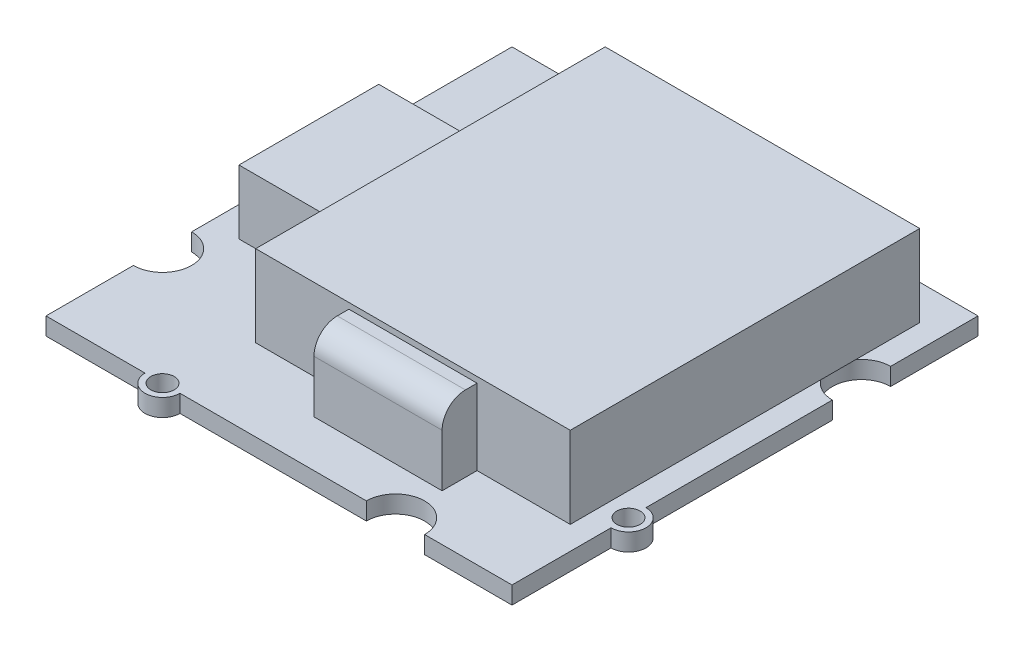
ISO-10303-21;
HEADER;
FILE_DESCRIPTION(('STEP AP214'),'2;1');
FILE_NAME('part.step','',(''),(''),'','','');
FILE_SCHEMA(('AUTOMOTIVE_DESIGN { 1 0 10303 214 1 1 1 1 }'));
ENDSEC;
DATA;
#1=APPLICATION_CONTEXT('core data for automotive mechanical design processes');
#2=APPLICATION_PROTOCOL_DEFINITION('international standard','automotive_design',2000,#1);
#3=PRODUCT_CONTEXT('',#1,'mechanical');
#4=PRODUCT('Part','Part','',(#3));
#5=PRODUCT_RELATED_PRODUCT_CATEGORY('part','',(#4));
#6=PRODUCT_DEFINITION_FORMATION('','',#4);
#7=PRODUCT_DEFINITION_CONTEXT('part definition',#1,'design');
#8=PRODUCT_DEFINITION('design','',#6,#7);
#9=PRODUCT_DEFINITION_SHAPE('','',#8);
#10=(LENGTH_UNIT() NAMED_UNIT(*) SI_UNIT(.MILLI.,.METRE.));
#11=(NAMED_UNIT(*) PLANE_ANGLE_UNIT() SI_UNIT($,.RADIAN.));
#12=(NAMED_UNIT(*) SI_UNIT($,.STERADIAN.) SOLID_ANGLE_UNIT());
#13=UNCERTAINTY_MEASURE_WITH_UNIT(LENGTH_MEASURE(1.E-05),#10,'distance_accuracy_value','');
#14=(GEOMETRIC_REPRESENTATION_CONTEXT(3) GLOBAL_UNCERTAINTY_ASSIGNED_CONTEXT((#13)) GLOBAL_UNIT_ASSIGNED_CONTEXT((#10,
#11,#12)) REPRESENTATION_CONTEXT('',''));
#15=CARTESIAN_POINT('',(0.,0.,0.));
#16=DIRECTION('',(0.,0.,1.));
#17=DIRECTION('',(1.,0.,0.));
#18=AXIS2_PLACEMENT_3D('',#15,#16,#17);
#19=CARTESIAN_POINT('',(0.,1.5,0.));
#20=DIRECTION('',(0.,1.,0.));
#21=DIRECTION('',(0.,0.,1.));
#22=AXIS2_PLACEMENT_3D('',#19,#20,#21);
#23=PLANE('',#22);
#24=CARTESIAN_POINT('',(-10.,1.5,20.));
#25=DIRECTION('',(0.,1.,0.));
#26=DIRECTION('',(0.,0.,1.));
#27=AXIS2_PLACEMENT_3D('',#24,#25,#26);
#28=CIRCLE('',#27,1.);
#29=CARTESIAN_POINT('',(-10.,1.5,21.));
#30=VERTEX_POINT('',#29);
#31=EDGE_CURVE('E385',#30,#30,#28,.T.);
#32=ORIENTED_EDGE('',*,*,#31,.F.);
#33=EDGE_LOOP('',(#32));
#34=FACE_BOUND('',#33,.T.);
#35=CARTESIAN_POINT('',(20.,1.5,10.));
#36=DIRECTION('',(0.,1.,0.));
#37=DIRECTION('',(0.,0.,1.));
#38=AXIS2_PLACEMENT_3D('',#35,#36,#37);
#39=CIRCLE('',#38,1.);
#40=CARTESIAN_POINT('',(20.,1.5,11.));
#41=VERTEX_POINT('',#40);
#42=EDGE_CURVE('E389',#41,#41,#39,.T.);
#43=ORIENTED_EDGE('',*,*,#42,.F.);
#44=EDGE_LOOP('',(#43));
#45=FACE_BOUND('',#44,.T.);
#46=CARTESIAN_POINT('',(10.,1.5,-20.));
#47=DIRECTION('',(0.,1.,0.));
#48=DIRECTION('',(0.,0.,1.));
#49=AXIS2_PLACEMENT_3D('',#46,#47,#48);
#50=CIRCLE('',#49,1.);
#51=CARTESIAN_POINT('',(10.,1.5,-19.));
#52=VERTEX_POINT('',#51);
#53=EDGE_CURVE('E395',#52,#52,#50,.T.);
#54=ORIENTED_EDGE('',*,*,#53,.F.);
#55=EDGE_LOOP('',(#54));
#56=FACE_BOUND('',#55,.T.);
#57=CARTESIAN_POINT('',(-20.,1.5,-10.));
#58=DIRECTION('',(0.,1.,0.));
#59=DIRECTION('',(0.,0.,1.));
#60=AXIS2_PLACEMENT_3D('',#57,#58,#59);
#61=CIRCLE('',#60,1.);
#62=CARTESIAN_POINT('',(-20.,1.5,-9.));
#63=VERTEX_POINT('',#62);
#64=EDGE_CURVE('E401',#63,#63,#61,.T.);
#65=ORIENTED_EDGE('',*,*,#64,.F.);
#66=EDGE_LOOP('',(#65));
#67=FACE_BOUND('',#66,.T.);
#68=DIRECTION('',(-1.,0.,0.));
#69=VECTOR('',#68,1.);
#70=CARTESIAN_POINT('',(-17.4388898299039,1.5,-6.));
#71=LINE('',#70,#69);
#72=CARTESIAN_POINT('',(-9.43888982990389,1.5,-6.));
#73=VERTEX_POINT('',#72);
#74=CARTESIAN_POINT('',(-17.4388898299039,1.5,-6.));
#75=VERTEX_POINT('',#74);
#76=EDGE_CURVE('E329',#73,#75,#71,.T.);
#77=ORIENTED_EDGE('',*,*,#76,.F.);
#78=DIRECTION('',(0.,0.,-1.));
#79=VECTOR('',#78,1.);
#80=CARTESIAN_POINT('',(-9.43888982990389,1.5,-6.));
#81=LINE('',#80,#79);
#82=CARTESIAN_POINT('',(-9.43888982990389,1.5,6.));
#83=VERTEX_POINT('',#82);
#84=EDGE_CURVE('E315',#83,#73,#81,.T.);
#85=ORIENTED_EDGE('',*,*,#84,.F.);
#86=DIRECTION('',(1.,0.,0.));
#87=VECTOR('',#86,1.);
#88=CARTESIAN_POINT('',(-17.4388898299039,1.5,6.));
#89=LINE('',#88,#87);
#90=CARTESIAN_POINT('',(-17.4388898299039,1.5,6.));
#91=VERTEX_POINT('',#90);
#92=EDGE_CURVE('E320',#91,#83,#89,.T.);
#93=ORIENTED_EDGE('',*,*,#92,.F.);
#94=DIRECTION('',(0.,0.,1.));
#95=VECTOR('',#94,1.);
#96=CARTESIAN_POINT('',(-17.4388898299039,1.5,-6.));
#97=LINE('',#96,#95);
#98=EDGE_CURVE('E331',#75,#91,#97,.T.);
#99=ORIENTED_EDGE('',*,*,#98,.F.);
#100=EDGE_LOOP('',(#77,#85,#93,#99));
#101=FACE_BOUND('',#100,.T.);
#102=DIRECTION('',(1.,0.,0.));
#103=VECTOR('',#102,1.);
#104=CARTESIAN_POINT('',(-8.99999999999999,1.5,13.));
#105=LINE('',#104,#103);
#106=CARTESIAN_POINT('',(10.,1.5,13.));
#107=VERTEX_POINT('',#106);
#108=CARTESIAN_POINT('',(18.,1.5,13.));
#109=VERTEX_POINT('',#108);
#110=EDGE_CURVE('E303',#107,#109,#105,.T.);
#111=ORIENTED_EDGE('',*,*,#110,.F.);
#112=DIRECTION('',(0.,0.,-1.));
#113=VECTOR('',#112,1.);
#114=CARTESIAN_POINT('',(10.,1.5,13.));
#115=LINE('',#114,#113);
#116=CARTESIAN_POINT('',(10.,1.5,16.));
#117=VERTEX_POINT('',#116);
#118=EDGE_CURVE('E517',#117,#107,#115,.T.);
#119=ORIENTED_EDGE('',*,*,#118,.F.);
#120=DIRECTION('',(1.,0.,0.));
#121=VECTOR('',#120,1.);
#122=CARTESIAN_POINT('',(-0.999999999999996,1.5,16.));
#123=LINE('',#122,#121);
#124=CARTESIAN_POINT('',(-0.999999999999996,1.5,16.));
#125=VERTEX_POINT('',#124);
#126=EDGE_CURVE('E511',#125,#117,#123,.T.);
#127=ORIENTED_EDGE('',*,*,#126,.F.);
#128=DIRECTION('',(0.,0.,1.));
#129=VECTOR('',#128,1.);
#130=CARTESIAN_POINT('',(-0.999999999999996,1.5,13.));
#131=LINE('',#130,#129);
#132=CARTESIAN_POINT('',(-0.999999999999996,1.5,13.));
#133=VERTEX_POINT('',#132);
#134=EDGE_CURVE('E514',#133,#125,#131,.T.);
#135=ORIENTED_EDGE('',*,*,#134,.F.);
#136=CARTESIAN_POINT('',(-8.99999999999999,1.5,13.));
#137=VERTEX_POINT('',#136);
#138=EDGE_CURVE('E277',#137,#133,#105,.T.);
#139=ORIENTED_EDGE('',*,*,#138,.F.);
#140=DIRECTION('',(0.,0.,1.));
#141=VECTOR('',#140,1.);
#142=CARTESIAN_POINT('',(-9.,1.5,-17.));
#143=LINE('',#142,#141);
#144=CARTESIAN_POINT('',(-9.,1.5,-17.));
#145=VERTEX_POINT('',#144);
#146=EDGE_CURVE('E301',#145,#137,#143,.T.);
#147=ORIENTED_EDGE('',*,*,#146,.F.);
#148=DIRECTION('',(-1.,0.,0.));
#149=VECTOR('',#148,1.);
#150=CARTESIAN_POINT('',(-9.,1.5,-17.));
#151=LINE('',#150,#149);
#152=CARTESIAN_POINT('',(18.,1.5,-17.));
#153=VERTEX_POINT('',#152);
#154=EDGE_CURVE('E298',#153,#145,#151,.T.);
#155=ORIENTED_EDGE('',*,*,#154,.F.);
#156=DIRECTION('',(0.,0.,-1.));
#157=VECTOR('',#156,1.);
#158=CARTESIAN_POINT('',(18.,1.5,-17.));
#159=LINE('',#158,#157);
#160=CARTESIAN_POINT('',(18.,1.5,-11.5));
#161=VERTEX_POINT('',#160);
#162=EDGE_CURVE('E281',#161,#153,#159,.T.);
#163=ORIENTED_EDGE('',*,*,#162,.F.);
#164=CARTESIAN_POINT('',(20.,1.5,-10.));
#165=DIRECTION('',(0.,1.,0.));
#166=DIRECTION('',(0.,0.,1.));
#167=AXIS2_PLACEMENT_3D('',#164,#165,#166);
#168=CIRCLE('',#167,2.5);
#169=CARTESIAN_POINT('',(20.,1.5,-12.5));
#170=VERTEX_POINT('',#169);
#171=EDGE_CURVE('E367',#170,#161,#168,.T.);
#172=ORIENTED_EDGE('',*,*,#171,.F.);
#173=DIRECTION('',(0.,0.,-1.));
#174=VECTOR('',#173,1.);
#175=CARTESIAN_POINT('',(20.,1.5,-20.));
#176=LINE('',#175,#174);
#177=CARTESIAN_POINT('',(20.,1.5,-20.));
#178=VERTEX_POINT('',#177);
#179=EDGE_CURVE('E455',#170,#178,#176,.T.);
#180=ORIENTED_EDGE('',*,*,#179,.T.);
#181=DIRECTION('',(-1.,0.,0.));
#182=VECTOR('',#181,1.);
#183=CARTESIAN_POINT('',(-20.,1.5,-20.));
#184=LINE('',#183,#182);
#185=CARTESIAN_POINT('',(11.5,1.5,-20.));
#186=VERTEX_POINT('',#185);
#187=EDGE_CURVE('E456',#178,#186,#184,.T.);
#188=ORIENTED_EDGE('',*,*,#187,.T.);
#189=CARTESIAN_POINT('',(10.,1.5,-20.));
#190=DIRECTION('',(0.,1.,0.));
#191=DIRECTION('',(0.,0.,1.));
#192=AXIS2_PLACEMENT_3D('',#189,#190,#191);
#193=CIRCLE('',#192,1.5);
#194=CARTESIAN_POINT('',(8.5,1.5,-20.));
#195=VERTEX_POINT('',#194);
#196=EDGE_CURVE('E429',#186,#195,#193,.T.);
#197=ORIENTED_EDGE('',*,*,#196,.T.);
#198=CARTESIAN_POINT('',(-7.5,1.5,-20.));
#199=VERTEX_POINT('',#198);
#200=EDGE_CURVE('E460',#195,#199,#184,.T.);
#201=ORIENTED_EDGE('',*,*,#200,.T.);
#202=CARTESIAN_POINT('',(-10.,1.5,-20.));
#203=DIRECTION('',(0.,1.,0.));
#204=DIRECTION('',(0.,0.,1.));
#205=AXIS2_PLACEMENT_3D('',#202,#203,#204);
#206=CIRCLE('',#205,2.5);
#207=CARTESIAN_POINT('',(-12.5,1.5,-20.));
#208=VERTEX_POINT('',#207);
#209=EDGE_CURVE('E377',#208,#199,#206,.T.);
#210=ORIENTED_EDGE('',*,*,#209,.F.);
#211=CARTESIAN_POINT('',(-20.,1.5,-20.));
#212=VERTEX_POINT('',#211);
#213=EDGE_CURVE('E453',#208,#212,#184,.T.);
#214=ORIENTED_EDGE('',*,*,#213,.T.);
#215=DIRECTION('',(0.,0.,1.));
#216=VECTOR('',#215,1.);
#217=CARTESIAN_POINT('',(-20.,1.5,-20.));
#218=LINE('',#217,#216);
#219=CARTESIAN_POINT('',(-20.,1.5,-11.5));
#220=VERTEX_POINT('',#219);
#221=EDGE_CURVE('E461',#212,#220,#218,.T.);
#222=ORIENTED_EDGE('',*,*,#221,.T.);
#223=CARTESIAN_POINT('',(-20.,1.5,-10.));
#224=DIRECTION('',(0.,1.,0.));
#225=DIRECTION('',(0.,0.,1.));
#226=AXIS2_PLACEMENT_3D('',#223,#224,#225);
#227=CIRCLE('',#226,1.5);
#228=CARTESIAN_POINT('',(-20.,1.5,-8.5));
#229=VERTEX_POINT('',#228);
#230=EDGE_CURVE('E439',#220,#229,#227,.T.);
#231=ORIENTED_EDGE('',*,*,#230,.T.);
#232=CARTESIAN_POINT('',(-20.,1.5,7.5));
#233=VERTEX_POINT('',#232);
#234=EDGE_CURVE('E465',#229,#233,#218,.T.);
#235=ORIENTED_EDGE('',*,*,#234,.T.);
#236=CARTESIAN_POINT('',(-20.,1.5,10.));
#237=DIRECTION('',(0.,1.,0.));
#238=DIRECTION('',(0.,0.,1.));
#239=AXIS2_PLACEMENT_3D('',#236,#237,#238);
#240=CIRCLE('',#239,2.5);
#241=CARTESIAN_POINT('',(-20.,1.5,12.5));
#242=VERTEX_POINT('',#241);
#243=EDGE_CURVE('E344',#242,#233,#240,.T.);
#244=ORIENTED_EDGE('',*,*,#243,.F.);
#245=CARTESIAN_POINT('',(-20.,1.5,20.));
#246=VERTEX_POINT('',#245);
#247=EDGE_CURVE('E459',#242,#246,#218,.T.);
#248=ORIENTED_EDGE('',*,*,#247,.T.);
#249=DIRECTION('',(1.,0.,0.));
#250=VECTOR('',#249,1.);
#251=CARTESIAN_POINT('',(-20.,1.5,20.));
#252=LINE('',#251,#250);
#253=CARTESIAN_POINT('',(-11.5,1.5,20.));
#254=VERTEX_POINT('',#253);
#255=EDGE_CURVE('E466',#246,#254,#252,.T.);
#256=ORIENTED_EDGE('',*,*,#255,.T.);
#257=CARTESIAN_POINT('',(-10.,1.5,20.));
#258=DIRECTION('',(0.,1.,0.));
#259=DIRECTION('',(0.,0.,1.));
#260=AXIS2_PLACEMENT_3D('',#257,#258,#259);
#261=CIRCLE('',#260,1.5);
#262=CARTESIAN_POINT('',(-8.5,1.5,20.));
#263=VERTEX_POINT('',#262);
#264=EDGE_CURVE('E407',#254,#263,#261,.T.);
#265=ORIENTED_EDGE('',*,*,#264,.T.);
#266=CARTESIAN_POINT('',(7.50000000000001,1.5,20.));
#267=VERTEX_POINT('',#266);
#268=EDGE_CURVE('E470',#263,#267,#252,.T.);
#269=ORIENTED_EDGE('',*,*,#268,.T.);
#270=CARTESIAN_POINT('',(10.,1.5,20.));
#271=DIRECTION('',(0.,1.,0.));
#272=DIRECTION('',(0.,0.,1.));
#273=AXIS2_PLACEMENT_3D('',#270,#271,#272);
#274=CIRCLE('',#273,2.5);
#275=CARTESIAN_POINT('',(12.5,1.5,20.));
#276=VERTEX_POINT('',#275);
#277=EDGE_CURVE('E355',#276,#267,#274,.T.);
#278=ORIENTED_EDGE('',*,*,#277,.F.);
#279=CARTESIAN_POINT('',(20.,1.5,20.));
#280=VERTEX_POINT('',#279);
#281=EDGE_CURVE('E464',#276,#280,#252,.T.);
#282=ORIENTED_EDGE('',*,*,#281,.T.);
#283=CARTESIAN_POINT('',(20.,1.5,11.5));
#284=VERTEX_POINT('',#283);
#285=EDGE_CURVE('E450',#280,#284,#176,.T.);
#286=ORIENTED_EDGE('',*,*,#285,.T.);
#287=CARTESIAN_POINT('',(20.,1.5,10.));
#288=DIRECTION('',(0.,1.,0.));
#289=DIRECTION('',(0.,0.,1.));
#290=AXIS2_PLACEMENT_3D('',#287,#288,#289);
#291=CIRCLE('',#290,1.5);
#292=CARTESIAN_POINT('',(20.,1.5,8.5));
#293=VERTEX_POINT('',#292);
#294=EDGE_CURVE('E419',#284,#293,#291,.T.);
#295=ORIENTED_EDGE('',*,*,#294,.T.);
#296=CARTESIAN_POINT('',(20.,1.5,-7.5));
#297=VERTEX_POINT('',#296);
#298=EDGE_CURVE('E454',#293,#297,#176,.T.);
#299=ORIENTED_EDGE('',*,*,#298,.T.);
#300=CARTESIAN_POINT('',(18.,1.5,-8.5));
#301=VERTEX_POINT('',#300);
#302=EDGE_CURVE('E366',#301,#297,#168,.T.);
#303=ORIENTED_EDGE('',*,*,#302,.F.);
#304=EDGE_CURVE('E296',#109,#301,#159,.T.);
#305=ORIENTED_EDGE('',*,*,#304,.F.);
#306=EDGE_LOOP('',(#111,#119,#127,#135,#139,#147,#155,#163,#172,#180,#188,#197,#201,#210,#214,
#222,#231,#235,#244,#248,#256,#265,#269,#278,#282,#286,#295,#299,#303,#305));
#307=FACE_BOUND('',#306,.T.);
#308=ADVANCED_FACE('F34',(#34,#45,#56,#67,#101,#307),#23,.T.);
#309=CARTESIAN_POINT('',(-8.99999999999999,8.5,13.));
#310=DIRECTION('',(0.,0.,-1.));
#311=DIRECTION('',(-1.,0.,0.));
#312=AXIS2_PLACEMENT_3D('',#309,#310,#311);
#313=PLANE('',#312);
#314=DIRECTION('',(0.,-1.,0.));
#315=VECTOR('',#314,1.);
#316=CARTESIAN_POINT('',(10.,8.,13.));
#317=LINE('',#316,#315);
#318=CARTESIAN_POINT('',(10.,8.,13.));
#319=VERTEX_POINT('',#318);
#320=EDGE_CURVE('E278',#319,#107,#317,.T.);
#321=ORIENTED_EDGE('',*,*,#320,.T.);
#322=ORIENTED_EDGE('',*,*,#110,.T.);
#323=DIRECTION('',(0.,-1.,0.));
#324=VECTOR('',#323,1.);
#325=CARTESIAN_POINT('',(18.,8.5,13.));
#326=LINE('',#325,#324);
#327=CARTESIAN_POINT('',(18.,8.5,13.));
#328=VERTEX_POINT('',#327);
#329=EDGE_CURVE('E295',#328,#109,#326,.T.);
#330=ORIENTED_EDGE('',*,*,#329,.F.);
#331=DIRECTION('',(1.,0.,0.));
#332=VECTOR('',#331,1.);
#333=CARTESIAN_POINT('',(-8.99999999999999,8.5,13.));
#334=LINE('',#333,#332);
#335=CARTESIAN_POINT('',(-8.99999999999999,8.5,13.));
#336=VERTEX_POINT('',#335);
#337=EDGE_CURVE('E293',#336,#328,#334,.T.);
#338=ORIENTED_EDGE('',*,*,#337,.F.);
#339=DIRECTION('',(0.,-1.,0.));
#340=VECTOR('',#339,1.);
#341=CARTESIAN_POINT('',(-8.99999999999999,8.5,13.));
#342=LINE('',#341,#340);
#343=EDGE_CURVE('E307',#336,#137,#342,.T.);
#344=ORIENTED_EDGE('',*,*,#343,.T.);
#345=ORIENTED_EDGE('',*,*,#138,.T.);
#346=DIRECTION('',(0.,-1.,0.));
#347=VECTOR('',#346,1.);
#348=CARTESIAN_POINT('',(-0.999999999999996,8.,13.));
#349=LINE('',#348,#347);
#350=CARTESIAN_POINT('',(-0.999999999999996,8.,13.));
#351=VERTEX_POINT('',#350);
#352=EDGE_CURVE('E268',#351,#133,#349,.T.);
#353=ORIENTED_EDGE('',*,*,#352,.F.);
#354=DIRECTION('',(-1.,0.,0.));
#355=VECTOR('',#354,1.);
#356=CARTESIAN_POINT('',(-0.999999999999996,8.,13.));
#357=LINE('',#356,#355);
#358=EDGE_CURVE('E253',#319,#351,#357,.T.);
#359=ORIENTED_EDGE('',*,*,#358,.F.);
#360=EDGE_LOOP('',(#321,#322,#330,#338,#344,#345,#353,#359));
#361=FACE_BOUND('',#360,.T.);
#362=ADVANCED_FACE('F274',(#361),#313,.F.);
#363=CARTESIAN_POINT('',(-20.,1.5,-20.));
#364=DIRECTION('',(1.,0.,0.));
#365=DIRECTION('',(0.,0.,-1.));
#366=AXIS2_PLACEMENT_3D('',#363,#364,#365);
#367=PLANE('',#366);
#368=DIRECTION('',(0.,0.,1.));
#369=VECTOR('',#368,1.);
#370=CARTESIAN_POINT('',(-20.,0.,-20.));
#371=LINE('',#370,#369);
#372=CARTESIAN_POINT('',(-20.,0.,-8.5));
#373=VERTEX_POINT('',#372);
#374=CARTESIAN_POINT('',(-20.,0.,7.5));
#375=VERTEX_POINT('',#374);
#376=EDGE_CURVE('E485',#373,#375,#371,.T.);
#377=ORIENTED_EDGE('',*,*,#376,.T.);
#378=DIRECTION('',(0.,1.,0.));
#379=VECTOR('',#378,1.);
#380=CARTESIAN_POINT('',(-20.,0.,7.5));
#381=LINE('',#380,#379);
#382=EDGE_CURVE('E352',#375,#233,#381,.T.);
#383=ORIENTED_EDGE('',*,*,#382,.T.);
#384=ORIENTED_EDGE('',*,*,#234,.F.);
#385=DIRECTION('',(0.,1.,0.));
#386=VECTOR('',#385,1.);
#387=CARTESIAN_POINT('',(-20.,0.,-8.5));
#388=LINE('',#387,#386);
#389=EDGE_CURVE('E442',#229,#373,#388,.F.);
#390=ORIENTED_EDGE('',*,*,#389,.T.);
#391=EDGE_LOOP('',(#377,#383,#384,#390));
#392=FACE_BOUND('',#391,.T.);
#393=ADVANCED_FACE('F553',(#392),#367,.F.);
#394=CARTESIAN_POINT('',(-20.,1.5,20.));
#395=DIRECTION('',(0.,0.,-1.));
#396=DIRECTION('',(-1.,0.,0.));
#397=AXIS2_PLACEMENT_3D('',#394,#395,#396);
#398=PLANE('',#397);
#399=DIRECTION('',(1.,0.,0.));
#400=VECTOR('',#399,1.);
#401=CARTESIAN_POINT('',(-20.,0.,20.));
#402=LINE('',#401,#400);
#403=CARTESIAN_POINT('',(-8.5,0.,20.));
#404=VERTEX_POINT('',#403);
#405=CARTESIAN_POINT('',(7.50000000000001,0.,20.));
#406=VERTEX_POINT('',#405);
#407=EDGE_CURVE('E489',#404,#406,#402,.T.);
#408=ORIENTED_EDGE('',*,*,#407,.T.);
#409=DIRECTION('',(0.,1.,0.));
#410=VECTOR('',#409,1.);
#411=CARTESIAN_POINT('',(7.50000000000001,0.,20.));
#412=LINE('',#411,#410);
#413=EDGE_CURVE('E363',#406,#267,#412,.T.);
#414=ORIENTED_EDGE('',*,*,#413,.T.);
#415=ORIENTED_EDGE('',*,*,#268,.F.);
#416=DIRECTION('',(0.,1.,0.));
#417=VECTOR('',#416,1.);
#418=CARTESIAN_POINT('',(-8.5,0.,20.));
#419=LINE('',#418,#417);
#420=EDGE_CURVE('E412',#263,#404,#419,.F.);
#421=ORIENTED_EDGE('',*,*,#420,.T.);
#422=EDGE_LOOP('',(#408,#414,#415,#421));
#423=FACE_BOUND('',#422,.T.);
#424=ADVANCED_FACE('F570',(#423),#398,.F.);
#425=CARTESIAN_POINT('',(20.,1.5,-20.));
#426=DIRECTION('',(-1.,0.,0.));
#427=DIRECTION('',(0.,0.,1.));
#428=AXIS2_PLACEMENT_3D('',#425,#426,#427);
#429=PLANE('',#428);
#430=DIRECTION('',(0.,0.,-1.));
#431=VECTOR('',#430,1.);
#432=CARTESIAN_POINT('',(20.,0.,-20.));
#433=LINE('',#432,#431);
#434=CARTESIAN_POINT('',(20.,0.,8.5));
#435=VERTEX_POINT('',#434);
#436=CARTESIAN_POINT('',(20.,0.,-7.5));
#437=VERTEX_POINT('',#436);
#438=EDGE_CURVE('E475',#435,#437,#433,.T.);
#439=ORIENTED_EDGE('',*,*,#438,.T.);
#440=DIRECTION('',(0.,1.,0.));
#441=VECTOR('',#440,1.);
#442=CARTESIAN_POINT('',(20.,0.,-7.5));
#443=LINE('',#442,#441);
#444=EDGE_CURVE('E374',#437,#297,#443,.T.);
#445=ORIENTED_EDGE('',*,*,#444,.T.);
#446=ORIENTED_EDGE('',*,*,#298,.F.);
#447=DIRECTION('',(0.,1.,0.));
#448=VECTOR('',#447,1.);
#449=CARTESIAN_POINT('',(20.,0.,8.5));
#450=LINE('',#449,#448);
#451=EDGE_CURVE('E422',#293,#435,#450,.F.);
#452=ORIENTED_EDGE('',*,*,#451,.T.);
#453=EDGE_LOOP('',(#439,#445,#446,#452));
#454=FACE_BOUND('',#453,.T.);
#455=ADVANCED_FACE('F584',(#454),#429,.F.);
#456=CARTESIAN_POINT('',(-20.,1.5,-20.));
#457=DIRECTION('',(0.,0.,1.));
#458=DIRECTION('',(1.,0.,0.));
#459=AXIS2_PLACEMENT_3D('',#456,#457,#458);
#460=PLANE('',#459);
#461=DIRECTION('',(-1.,0.,0.));
#462=VECTOR('',#461,1.);
#463=CARTESIAN_POINT('',(-20.,0.,-20.));
#464=LINE('',#463,#462);
#465=CARTESIAN_POINT('',(8.5,0.,-20.));
#466=VERTEX_POINT('',#465);
#467=CARTESIAN_POINT('',(-7.5,0.,-20.));
#468=VERTEX_POINT('',#467);
#469=EDGE_CURVE('E480',#466,#468,#464,.T.);
#470=ORIENTED_EDGE('',*,*,#469,.T.);
#471=DIRECTION('',(0.,1.,0.));
#472=VECTOR('',#471,1.);
#473=CARTESIAN_POINT('',(-7.5,0.,-20.));
#474=LINE('',#473,#472);
#475=EDGE_CURVE('E382',#468,#199,#474,.T.);
#476=ORIENTED_EDGE('',*,*,#475,.T.);
#477=ORIENTED_EDGE('',*,*,#200,.F.);
#478=DIRECTION('',(0.,1.,0.));
#479=VECTOR('',#478,1.);
#480=CARTESIAN_POINT('',(8.5,0.,-20.));
#481=LINE('',#480,#479);
#482=EDGE_CURVE('E432',#195,#466,#481,.F.);
#483=ORIENTED_EDGE('',*,*,#482,.T.);
#484=EDGE_LOOP('',(#470,#476,#477,#483));
#485=FACE_BOUND('',#484,.T.);
#486=ADVANCED_FACE('F580',(#485),#460,.F.);
#487=CARTESIAN_POINT('',(-20.,0.,20.));
#488=VERTEX_POINT('',#487);
#489=CARTESIAN_POINT('',(-11.5,0.,20.));
#490=VERTEX_POINT('',#489);
#491=EDGE_CURVE('E486',#488,#490,#402,.T.);
#492=ORIENTED_EDGE('',*,*,#491,.T.);
#493=DIRECTION('',(0.,1.,0.));
#494=VECTOR('',#493,1.);
#495=CARTESIAN_POINT('',(-11.5,0.,20.));
#496=LINE('',#495,#494);
#497=EDGE_CURVE('E416',#490,#254,#496,.T.);
#498=ORIENTED_EDGE('',*,*,#497,.T.);
#499=ORIENTED_EDGE('',*,*,#255,.F.);
#500=DIRECTION('',(0.,-1.,0.));
#501=VECTOR('',#500,1.);
#502=CARTESIAN_POINT('',(-20.,1.5,20.));
#503=LINE('',#502,#501);
#504=EDGE_CURVE('E492',#246,#488,#503,.T.);
#505=ORIENTED_EDGE('',*,*,#504,.T.);
#506=EDGE_LOOP('',(#492,#498,#499,#505));
#507=FACE_BOUND('',#506,.T.);
#508=ADVANCED_FACE('F571',(#507),#398,.F.);
#509=CARTESIAN_POINT('',(20.,0.,20.));
#510=VERTEX_POINT('',#509);
#511=CARTESIAN_POINT('',(20.,0.,11.5));
#512=VERTEX_POINT('',#511);
#513=EDGE_CURVE('E471',#510,#512,#433,.T.);
#514=ORIENTED_EDGE('',*,*,#513,.T.);
#515=DIRECTION('',(0.,1.,0.));
#516=VECTOR('',#515,1.);
#517=CARTESIAN_POINT('',(20.,0.,11.5));
#518=LINE('',#517,#516);
#519=EDGE_CURVE('E426',#512,#284,#518,.T.);
#520=ORIENTED_EDGE('',*,*,#519,.T.);
#521=ORIENTED_EDGE('',*,*,#285,.F.);
#522=DIRECTION('',(0.,-1.,0.));
#523=VECTOR('',#522,1.);
#524=CARTESIAN_POINT('',(20.,1.5,20.));
#525=LINE('',#524,#523);
#526=EDGE_CURVE('E469',#280,#510,#525,.T.);
#527=ORIENTED_EDGE('',*,*,#526,.T.);
#528=EDGE_LOOP('',(#514,#520,#521,#527));
#529=FACE_BOUND('',#528,.T.);
#530=ADVANCED_FACE('F585',(#529),#429,.F.);
#531=CARTESIAN_POINT('',(20.,0.,-20.));
#532=VERTEX_POINT('',#531);
#533=CARTESIAN_POINT('',(11.5,0.,-20.));
#534=VERTEX_POINT('',#533);
#535=EDGE_CURVE('E476',#532,#534,#464,.T.);
#536=ORIENTED_EDGE('',*,*,#535,.T.);
#537=DIRECTION('',(0.,1.,0.));
#538=VECTOR('',#537,1.);
#539=CARTESIAN_POINT('',(11.5,0.,-20.));
#540=LINE('',#539,#538);
#541=EDGE_CURVE('E436',#534,#186,#540,.T.);
#542=ORIENTED_EDGE('',*,*,#541,.T.);
#543=ORIENTED_EDGE('',*,*,#187,.F.);
#544=DIRECTION('',(0.,-1.,0.));
#545=VECTOR('',#544,1.);
#546=CARTESIAN_POINT('',(20.,1.5,-20.));
#547=LINE('',#546,#545);
#548=EDGE_CURVE('E498',#178,#532,#547,.T.);
#549=ORIENTED_EDGE('',*,*,#548,.T.);
#550=EDGE_LOOP('',(#536,#542,#543,#549));
#551=FACE_BOUND('',#550,.T.);
#552=ADVANCED_FACE('F581',(#551),#460,.F.);
#553=CARTESIAN_POINT('',(-20.,0.,-20.));
#554=VERTEX_POINT('',#553);
#555=CARTESIAN_POINT('',(-20.,0.,-11.5));
#556=VERTEX_POINT('',#555);
#557=EDGE_CURVE('E481',#554,#556,#371,.T.);
#558=ORIENTED_EDGE('',*,*,#557,.T.);
#559=DIRECTION('',(0.,1.,0.));
#560=VECTOR('',#559,1.);
#561=CARTESIAN_POINT('',(-20.,0.,-11.5));
#562=LINE('',#561,#560);
#563=EDGE_CURVE('E446',#556,#220,#562,.T.);
#564=ORIENTED_EDGE('',*,*,#563,.T.);
#565=ORIENTED_EDGE('',*,*,#221,.F.);
#566=DIRECTION('',(0.,-1.,0.));
#567=VECTOR('',#566,1.);
#568=CARTESIAN_POINT('',(-20.,1.5,-20.));
#569=LINE('',#568,#567);
#570=EDGE_CURVE('E495',#212,#554,#569,.T.);
#571=ORIENTED_EDGE('',*,*,#570,.T.);
#572=EDGE_LOOP('',(#558,#564,#565,#571));
#573=FACE_BOUND('',#572,.T.);
#574=ADVANCED_FACE('F576',(#573),#367,.F.);
#575=ORIENTED_EDGE('',*,*,#179,.F.);
#576=DIRECTION('',(0.,1.,0.));
#577=VECTOR('',#576,1.);
#578=CARTESIAN_POINT('',(20.,0.,-12.5));
#579=LINE('',#578,#577);
#580=CARTESIAN_POINT('',(20.,0.,-12.5));
#581=VERTEX_POINT('',#580);
#582=EDGE_CURVE('E370',#170,#581,#579,.F.);
#583=ORIENTED_EDGE('',*,*,#582,.T.);
#584=EDGE_CURVE('E449',#581,#532,#433,.T.);
#585=ORIENTED_EDGE('',*,*,#584,.T.);
#586=ORIENTED_EDGE('',*,*,#548,.F.);
#587=EDGE_LOOP('',(#575,#583,#585,#586));
#588=FACE_BOUND('',#587,.T.);
#589=ADVANCED_FACE('F578',(#588),#429,.F.);
#590=ORIENTED_EDGE('',*,*,#213,.F.);
#591=DIRECTION('',(0.,1.,0.));
#592=VECTOR('',#591,1.);
#593=CARTESIAN_POINT('',(-12.5,0.,-20.));
#594=LINE('',#593,#592);
#595=CARTESIAN_POINT('',(-12.5,0.,-20.));
#596=VERTEX_POINT('',#595);
#597=EDGE_CURVE('E379',#208,#596,#594,.F.);
#598=ORIENTED_EDGE('',*,*,#597,.T.);
#599=EDGE_CURVE('E474',#596,#554,#464,.T.);
#600=ORIENTED_EDGE('',*,*,#599,.T.);
#601=ORIENTED_EDGE('',*,*,#570,.F.);
#602=EDGE_LOOP('',(#590,#598,#600,#601));
#603=FACE_BOUND('',#602,.T.);
#604=ADVANCED_FACE('F574',(#603),#460,.F.);
#605=ORIENTED_EDGE('',*,*,#247,.F.);
#606=DIRECTION('',(0.,1.,0.));
#607=VECTOR('',#606,1.);
#608=CARTESIAN_POINT('',(-20.,0.,12.5));
#609=LINE('',#608,#607);
#610=CARTESIAN_POINT('',(-20.,0.,12.5));
#611=VERTEX_POINT('',#610);
#612=EDGE_CURVE('E348',#242,#611,#609,.F.);
#613=ORIENTED_EDGE('',*,*,#612,.T.);
#614=EDGE_CURVE('E479',#611,#488,#371,.T.);
#615=ORIENTED_EDGE('',*,*,#614,.T.);
#616=ORIENTED_EDGE('',*,*,#504,.F.);
#617=EDGE_LOOP('',(#605,#613,#615,#616));
#618=FACE_BOUND('',#617,.T.);
#619=ADVANCED_FACE('F568',(#618),#367,.F.);
#620=ORIENTED_EDGE('',*,*,#281,.F.);
#621=DIRECTION('',(0.,1.,0.));
#622=VECTOR('',#621,1.);
#623=CARTESIAN_POINT('',(12.5,0.,20.));
#624=LINE('',#623,#622);
#625=CARTESIAN_POINT('',(12.5,0.,20.));
#626=VERTEX_POINT('',#625);
#627=EDGE_CURVE('E359',#276,#626,#624,.F.);
#628=ORIENTED_EDGE('',*,*,#627,.T.);
#629=EDGE_CURVE('E484',#626,#510,#402,.T.);
#630=ORIENTED_EDGE('',*,*,#629,.T.);
#631=ORIENTED_EDGE('',*,*,#526,.F.);
#632=EDGE_LOOP('',(#620,#628,#630,#631));
#633=FACE_BOUND('',#632,.T.);
#634=ADVANCED_FACE('F564',(#633),#398,.F.);
#635=CARTESIAN_POINT('',(0.,0.,0.));
#636=DIRECTION('',(0.,1.,0.));
#637=DIRECTION('',(0.,0.,1.));
#638=AXIS2_PLACEMENT_3D('',#635,#636,#637);
#639=PLANE('',#638);
#640=CARTESIAN_POINT('',(-10.,0.,20.));
#641=DIRECTION('',(0.,1.,0.));
#642=DIRECTION('',(0.,0.,1.));
#643=AXIS2_PLACEMENT_3D('',#640,#641,#642);
#644=CIRCLE('',#643,1.);
#645=CARTESIAN_POINT('',(-10.,0.,21.));
#646=VERTEX_POINT('',#645);
#647=EDGE_CURVE('E386',#646,#646,#644,.T.);
#648=ORIENTED_EDGE('',*,*,#647,.T.);
#649=EDGE_LOOP('',(#648));
#650=FACE_BOUND('',#649,.T.);
#651=CARTESIAN_POINT('',(20.,0.,10.));
#652=DIRECTION('',(0.,1.,0.));
#653=DIRECTION('',(0.,0.,1.));
#654=AXIS2_PLACEMENT_3D('',#651,#652,#653);
#655=CIRCLE('',#654,1.);
#656=CARTESIAN_POINT('',(20.,0.,11.));
#657=VERTEX_POINT('',#656);
#658=EDGE_CURVE('E392',#657,#657,#655,.T.);
#659=ORIENTED_EDGE('',*,*,#658,.T.);
#660=EDGE_LOOP('',(#659));
#661=FACE_BOUND('',#660,.T.);
#662=CARTESIAN_POINT('',(10.,0.,-20.));
#663=DIRECTION('',(0.,1.,0.));
#664=DIRECTION('',(0.,0.,1.));
#665=AXIS2_PLACEMENT_3D('',#662,#663,#664);
#666=CIRCLE('',#665,1.);
#667=CARTESIAN_POINT('',(10.,0.,-19.));
#668=VERTEX_POINT('',#667);
#669=EDGE_CURVE('E398',#668,#668,#666,.T.);
#670=ORIENTED_EDGE('',*,*,#669,.T.);
#671=EDGE_LOOP('',(#670));
#672=FACE_BOUND('',#671,.T.);
#673=CARTESIAN_POINT('',(-20.,0.,-10.));
#674=DIRECTION('',(0.,1.,0.));
#675=DIRECTION('',(0.,0.,1.));
#676=AXIS2_PLACEMENT_3D('',#673,#674,#675);
#677=CIRCLE('',#676,1.);
#678=CARTESIAN_POINT('',(-20.,0.,-9.));
#679=VERTEX_POINT('',#678);
#680=EDGE_CURVE('E404',#679,#679,#677,.T.);
#681=ORIENTED_EDGE('',*,*,#680,.T.);
#682=EDGE_LOOP('',(#681));
#683=FACE_BOUND('',#682,.T.);
#684=ORIENTED_EDGE('',*,*,#614,.F.);
#685=CARTESIAN_POINT('',(-20.,0.,10.));
#686=DIRECTION('',(0.,1.,0.));
#687=DIRECTION('',(0.,0.,1.));
#688=AXIS2_PLACEMENT_3D('',#685,#686,#687);
#689=CIRCLE('',#688,2.5);
#690=EDGE_CURVE('E345',#611,#375,#689,.T.);
#691=ORIENTED_EDGE('',*,*,#690,.T.);
#692=ORIENTED_EDGE('',*,*,#376,.F.);
#693=CARTESIAN_POINT('',(-20.,0.,-10.));
#694=DIRECTION('',(0.,1.,0.));
#695=DIRECTION('',(0.,0.,1.));
#696=AXIS2_PLACEMENT_3D('',#693,#694,#695);
#697=CIRCLE('',#696,1.5);
#698=EDGE_CURVE('E440',#556,#373,#697,.T.);
#699=ORIENTED_EDGE('',*,*,#698,.F.);
#700=ORIENTED_EDGE('',*,*,#557,.F.);
#701=ORIENTED_EDGE('',*,*,#599,.F.);
#702=CARTESIAN_POINT('',(-10.,0.,-20.));
#703=DIRECTION('',(0.,1.,0.));
#704=DIRECTION('',(0.,0.,1.));
#705=AXIS2_PLACEMENT_3D('',#702,#703,#704);
#706=CIRCLE('',#705,2.5);
#707=EDGE_CURVE('E501',#596,#468,#706,.T.);
#708=ORIENTED_EDGE('',*,*,#707,.T.);
#709=ORIENTED_EDGE('',*,*,#469,.F.);
#710=CARTESIAN_POINT('',(10.,0.,-20.));
#711=DIRECTION('',(0.,1.,0.));
#712=DIRECTION('',(0.,0.,1.));
#713=AXIS2_PLACEMENT_3D('',#710,#711,#712);
#714=CIRCLE('',#713,1.5);
#715=EDGE_CURVE('E430',#534,#466,#714,.T.);
#716=ORIENTED_EDGE('',*,*,#715,.F.);
#717=ORIENTED_EDGE('',*,*,#535,.F.);
#718=ORIENTED_EDGE('',*,*,#584,.F.);
#719=CARTESIAN_POINT('',(20.,0.,-10.));
#720=DIRECTION('',(0.,1.,0.));
#721=DIRECTION('',(0.,0.,1.));
#722=AXIS2_PLACEMENT_3D('',#719,#720,#721);
#723=CIRCLE('',#722,2.5);
#724=EDGE_CURVE('E504',#581,#437,#723,.T.);
#725=ORIENTED_EDGE('',*,*,#724,.T.);
#726=ORIENTED_EDGE('',*,*,#438,.F.);
#727=CARTESIAN_POINT('',(20.,0.,10.));
#728=DIRECTION('',(0.,1.,0.));
#729=DIRECTION('',(0.,0.,1.));
#730=AXIS2_PLACEMENT_3D('',#727,#728,#729);
#731=CIRCLE('',#730,1.5);
#732=EDGE_CURVE('E420',#512,#435,#731,.T.);
#733=ORIENTED_EDGE('',*,*,#732,.F.);
#734=ORIENTED_EDGE('',*,*,#513,.F.);
#735=ORIENTED_EDGE('',*,*,#629,.F.);
#736=CARTESIAN_POINT('',(10.,0.,20.));
#737=DIRECTION('',(0.,1.,0.));
#738=DIRECTION('',(0.,0.,1.));
#739=AXIS2_PLACEMENT_3D('',#736,#737,#738);
#740=CIRCLE('',#739,2.5);
#741=EDGE_CURVE('E356',#626,#406,#740,.T.);
#742=ORIENTED_EDGE('',*,*,#741,.T.);
#743=ORIENTED_EDGE('',*,*,#407,.F.);
#744=CARTESIAN_POINT('',(-10.,0.,20.));
#745=DIRECTION('',(0.,1.,0.));
#746=DIRECTION('',(0.,0.,1.));
#747=AXIS2_PLACEMENT_3D('',#744,#745,#746);
#748=CIRCLE('',#747,1.5);
#749=EDGE_CURVE('E410',#490,#404,#748,.T.);
#750=ORIENTED_EDGE('',*,*,#749,.F.);
#751=ORIENTED_EDGE('',*,*,#491,.F.);
#752=EDGE_LOOP('',(#684,#691,#692,#699,#700,#701,#708,#709,#716,#717,#718,#725,#726,#733,#734,
#735,#742,#743,#750,#751));
#753=FACE_BOUND('',#752,.T.);
#754=ADVANCED_FACE('F561',(#650,#661,#672,#683,#753),#639,.F.);
#755=CARTESIAN_POINT('',(-20.,0.,-10.));
#756=DIRECTION('',(0.,1.,0.));
#757=DIRECTION('',(0.,0.,1.));
#758=AXIS2_PLACEMENT_3D('',#755,#756,#757);
#759=CYLINDRICAL_SURFACE('',#758,1.5);
#760=ORIENTED_EDGE('',*,*,#563,.F.);
#761=ORIENTED_EDGE('',*,*,#698,.T.);
#762=ORIENTED_EDGE('',*,*,#389,.F.);
#763=ORIENTED_EDGE('',*,*,#230,.F.);
#764=EDGE_LOOP('',(#760,#761,#762,#763));
#765=FACE_BOUND('',#764,.T.);
#766=ADVANCED_FACE('F559',(#765),#759,.T.);
#767=CARTESIAN_POINT('',(10.,0.,-20.));
#768=DIRECTION('',(0.,1.,0.));
#769=DIRECTION('',(0.,0.,1.));
#770=AXIS2_PLACEMENT_3D('',#767,#768,#769);
#771=CYLINDRICAL_SURFACE('',#770,1.5);
#772=ORIENTED_EDGE('',*,*,#541,.F.);
#773=ORIENTED_EDGE('',*,*,#715,.T.);
#774=ORIENTED_EDGE('',*,*,#482,.F.);
#775=ORIENTED_EDGE('',*,*,#196,.F.);
#776=EDGE_LOOP('',(#772,#773,#774,#775));
#777=FACE_BOUND('',#776,.T.);
#778=ADVANCED_FACE('F626',(#777),#771,.T.);
#779=CARTESIAN_POINT('',(20.,0.,10.));
#780=DIRECTION('',(0.,1.,0.));
#781=DIRECTION('',(0.,0.,1.));
#782=AXIS2_PLACEMENT_3D('',#779,#780,#781);
#783=CYLINDRICAL_SURFACE('',#782,1.5);
#784=ORIENTED_EDGE('',*,*,#519,.F.);
#785=ORIENTED_EDGE('',*,*,#732,.T.);
#786=ORIENTED_EDGE('',*,*,#451,.F.);
#787=ORIENTED_EDGE('',*,*,#294,.F.);
#788=EDGE_LOOP('',(#784,#785,#786,#787));
#789=FACE_BOUND('',#788,.T.);
#790=ADVANCED_FACE('F612',(#789),#783,.T.);
#791=CARTESIAN_POINT('',(-10.,0.,20.));
#792=DIRECTION('',(0.,1.,0.));
#793=DIRECTION('',(0.,0.,1.));
#794=AXIS2_PLACEMENT_3D('',#791,#792,#793);
#795=CYLINDRICAL_SURFACE('',#794,1.5);
#796=ORIENTED_EDGE('',*,*,#497,.F.);
#797=ORIENTED_EDGE('',*,*,#749,.T.);
#798=ORIENTED_EDGE('',*,*,#420,.F.);
#799=ORIENTED_EDGE('',*,*,#264,.F.);
#800=EDGE_LOOP('',(#796,#797,#798,#799));
#801=FACE_BOUND('',#800,.T.);
#802=ADVANCED_FACE('F651',(#801),#795,.T.);
#803=CARTESIAN_POINT('',(-20.,0.,-10.));
#804=DIRECTION('',(0.,1.,0.));
#805=DIRECTION('',(0.,0.,1.));
#806=AXIS2_PLACEMENT_3D('',#803,#804,#805);
#807=CYLINDRICAL_SURFACE('',#806,1.);
#808=ORIENTED_EDGE('',*,*,#680,.F.);
#809=EDGE_LOOP('',(#808));
#810=FACE_BOUND('',#809,.T.);
#811=ORIENTED_EDGE('',*,*,#64,.T.);
#812=EDGE_LOOP('',(#811));
#813=FACE_BOUND('',#812,.T.);
#814=ADVANCED_FACE('F689',(#810,#813),#807,.F.);
#815=CARTESIAN_POINT('',(10.,0.,-20.));
#816=DIRECTION('',(0.,1.,0.));
#817=DIRECTION('',(0.,0.,1.));
#818=AXIS2_PLACEMENT_3D('',#815,#816,#817);
#819=CYLINDRICAL_SURFACE('',#818,1.);
#820=ORIENTED_EDGE('',*,*,#669,.F.);
#821=EDGE_LOOP('',(#820));
#822=FACE_BOUND('',#821,.T.);
#823=ORIENTED_EDGE('',*,*,#53,.T.);
#824=EDGE_LOOP('',(#823));
#825=FACE_BOUND('',#824,.T.);
#826=ADVANCED_FACE('F685',(#822,#825),#819,.F.);
#827=CARTESIAN_POINT('',(20.,0.,10.));
#828=DIRECTION('',(0.,1.,0.));
#829=DIRECTION('',(0.,0.,1.));
#830=AXIS2_PLACEMENT_3D('',#827,#828,#829);
#831=CYLINDRICAL_SURFACE('',#830,1.);
#832=ORIENTED_EDGE('',*,*,#658,.F.);
#833=EDGE_LOOP('',(#832));
#834=FACE_BOUND('',#833,.T.);
#835=ORIENTED_EDGE('',*,*,#42,.T.);
#836=EDGE_LOOP('',(#835));
#837=FACE_BOUND('',#836,.T.);
#838=ADVANCED_FACE('F681',(#834,#837),#831,.F.);
#839=CARTESIAN_POINT('',(-10.,0.,20.));
#840=DIRECTION('',(0.,1.,0.));
#841=DIRECTION('',(0.,0.,1.));
#842=AXIS2_PLACEMENT_3D('',#839,#840,#841);
#843=CYLINDRICAL_SURFACE('',#842,1.);
#844=ORIENTED_EDGE('',*,*,#647,.F.);
#845=EDGE_LOOP('',(#844));
#846=FACE_BOUND('',#845,.T.);
#847=ORIENTED_EDGE('',*,*,#31,.T.);
#848=EDGE_LOOP('',(#847));
#849=FACE_BOUND('',#848,.T.);
#850=ADVANCED_FACE('F677',(#846,#849),#843,.F.);
#851=CARTESIAN_POINT('',(-10.,0.,-20.));
#852=DIRECTION('',(0.,1.,0.));
#853=DIRECTION('',(0.,0.,1.));
#854=AXIS2_PLACEMENT_3D('',#851,#852,#853);
#855=CYLINDRICAL_SURFACE('',#854,2.5);
#856=ORIENTED_EDGE('',*,*,#707,.F.);
#857=ORIENTED_EDGE('',*,*,#597,.F.);
#858=ORIENTED_EDGE('',*,*,#209,.T.);
#859=ORIENTED_EDGE('',*,*,#475,.F.);
#860=EDGE_LOOP('',(#856,#857,#858,#859));
#861=FACE_BOUND('',#860,.T.);
#862=ADVANCED_FACE('F670',(#861),#855,.F.);
#863=CARTESIAN_POINT('',(20.,0.,-10.));
#864=DIRECTION('',(0.,1.,0.));
#865=DIRECTION('',(0.,0.,1.));
#866=AXIS2_PLACEMENT_3D('',#863,#864,#865);
#867=CYLINDRICAL_SURFACE('',#866,2.5);
#868=ORIENTED_EDGE('',*,*,#724,.F.);
#869=ORIENTED_EDGE('',*,*,#582,.F.);
#870=ORIENTED_EDGE('',*,*,#171,.T.);
#871=EDGE_CURVE('E371',#161,#301,#168,.T.);
#872=ORIENTED_EDGE('',*,*,#871,.T.);
#873=ORIENTED_EDGE('',*,*,#302,.T.);
#874=ORIENTED_EDGE('',*,*,#444,.F.);
#875=EDGE_LOOP('',(#868,#869,#870,#872,#873,#874));
#876=FACE_BOUND('',#875,.T.);
#877=ADVANCED_FACE('F661',(#876),#867,.F.);
#878=CARTESIAN_POINT('',(10.,0.,20.));
#879=DIRECTION('',(0.,1.,0.));
#880=DIRECTION('',(0.,0.,1.));
#881=AXIS2_PLACEMENT_3D('',#878,#879,#880);
#882=CYLINDRICAL_SURFACE('',#881,2.5);
#883=ORIENTED_EDGE('',*,*,#741,.F.);
#884=ORIENTED_EDGE('',*,*,#627,.F.);
#885=ORIENTED_EDGE('',*,*,#277,.T.);
#886=ORIENTED_EDGE('',*,*,#413,.F.);
#887=EDGE_LOOP('',(#883,#884,#885,#886));
#888=FACE_BOUND('',#887,.T.);
#889=ADVANCED_FACE('F658',(#888),#882,.F.);
#890=CARTESIAN_POINT('',(-20.,0.,10.));
#891=DIRECTION('',(0.,1.,0.));
#892=DIRECTION('',(0.,0.,1.));
#893=AXIS2_PLACEMENT_3D('',#890,#891,#892);
#894=CYLINDRICAL_SURFACE('',#893,2.5);
#895=ORIENTED_EDGE('',*,*,#690,.F.);
#896=ORIENTED_EDGE('',*,*,#612,.F.);
#897=ORIENTED_EDGE('',*,*,#243,.T.);
#898=ORIENTED_EDGE('',*,*,#382,.F.);
#899=EDGE_LOOP('',(#895,#896,#897,#898));
#900=FACE_BOUND('',#899,.T.);
#901=ADVANCED_FACE('F660',(#900),#894,.F.);
#902=CARTESIAN_POINT('',(-9.43888982990389,7.,-6.));
#903=DIRECTION('',(-1.,0.,0.));
#904=DIRECTION('',(0.,0.,1.));
#905=AXIS2_PLACEMENT_3D('',#902,#903,#904);
#906=PLANE('',#905);
#907=ORIENTED_EDGE('',*,*,#84,.T.);
#908=DIRECTION('',(0.,-1.,0.));
#909=VECTOR('',#908,1.);
#910=CARTESIAN_POINT('',(-9.43888982990389,7.,-6.));
#911=LINE('',#910,#909);
#912=CARTESIAN_POINT('',(-9.43888982990389,7.,-6.));
#913=VERTEX_POINT('',#912);
#914=EDGE_CURVE('E342',#913,#73,#911,.T.);
#915=ORIENTED_EDGE('',*,*,#914,.F.);
#916=DIRECTION('',(0.,0.,-1.));
#917=VECTOR('',#916,1.);
#918=CARTESIAN_POINT('',(-9.43888982990389,7.,-6.));
#919=LINE('',#918,#917);
#920=CARTESIAN_POINT('',(-9.43888982990389,7.,6.));
#921=VERTEX_POINT('',#920);
#922=EDGE_CURVE('E316',#921,#913,#919,.T.);
#923=ORIENTED_EDGE('',*,*,#922,.F.);
#924=DIRECTION('',(0.,-1.,0.));
#925=VECTOR('',#924,1.);
#926=CARTESIAN_POINT('',(-9.43888982990389,7.,6.));
#927=LINE('',#926,#925);
#928=EDGE_CURVE('E326',#921,#83,#927,.T.);
#929=ORIENTED_EDGE('',*,*,#928,.T.);
#930=EDGE_LOOP('',(#907,#915,#923,#929));
#931=FACE_BOUND('',#930,.T.);
#932=ADVANCED_FACE('F667',(#931),#906,.F.);
#933=CARTESIAN_POINT('',(-17.4388898299039,7.,-6.));
#934=DIRECTION('',(0.,0.,1.));
#935=DIRECTION('',(1.,0.,0.));
#936=AXIS2_PLACEMENT_3D('',#933,#934,#935);
#937=PLANE('',#936);
#938=ORIENTED_EDGE('',*,*,#76,.T.);
#939=DIRECTION('',(0.,-1.,0.));
#940=VECTOR('',#939,1.);
#941=CARTESIAN_POINT('',(-17.4388898299039,7.,-6.));
#942=LINE('',#941,#940);
#943=CARTESIAN_POINT('',(-17.4388898299039,7.,-6.));
#944=VERTEX_POINT('',#943);
#945=EDGE_CURVE('E339',#944,#75,#942,.T.);
#946=ORIENTED_EDGE('',*,*,#945,.F.);
#947=DIRECTION('',(-1.,0.,0.));
#948=VECTOR('',#947,1.);
#949=CARTESIAN_POINT('',(-17.4388898299039,7.,-6.));
#950=LINE('',#949,#948);
#951=EDGE_CURVE('E319',#913,#944,#950,.T.);
#952=ORIENTED_EDGE('',*,*,#951,.F.);
#953=ORIENTED_EDGE('',*,*,#914,.T.);
#954=EDGE_LOOP('',(#938,#946,#952,#953));
#955=FACE_BOUND('',#954,.T.);
#956=ADVANCED_FACE('F948',(#955),#937,.F.);
#957=CARTESIAN_POINT('',(-17.4388898299039,7.,-6.));
#958=DIRECTION('',(1.,0.,0.));
#959=DIRECTION('',(0.,0.,-1.));
#960=AXIS2_PLACEMENT_3D('',#957,#958,#959);
#961=PLANE('',#960);
#962=ORIENTED_EDGE('',*,*,#98,.T.);
#963=DIRECTION('',(0.,-1.,0.));
#964=VECTOR('',#963,1.);
#965=CARTESIAN_POINT('',(-17.4388898299039,7.,6.));
#966=LINE('',#965,#964);
#967=CARTESIAN_POINT('',(-17.4388898299039,7.,6.));
#968=VERTEX_POINT('',#967);
#969=EDGE_CURVE('E337',#968,#91,#966,.T.);
#970=ORIENTED_EDGE('',*,*,#969,.F.);
#971=DIRECTION('',(0.,0.,1.));
#972=VECTOR('',#971,1.);
#973=CARTESIAN_POINT('',(-17.4388898299039,7.,-6.));
#974=LINE('',#973,#972);
#975=EDGE_CURVE('E322',#944,#968,#974,.T.);
#976=ORIENTED_EDGE('',*,*,#975,.F.);
#977=ORIENTED_EDGE('',*,*,#945,.T.);
#978=EDGE_LOOP('',(#962,#970,#976,#977));
#979=FACE_BOUND('',#978,.T.);
#980=ADVANCED_FACE('F944',(#979),#961,.F.);
#981=CARTESIAN_POINT('',(-17.4388898299039,7.,6.));
#982=DIRECTION('',(0.,0.,-1.));
#983=DIRECTION('',(-1.,0.,0.));
#984=AXIS2_PLACEMENT_3D('',#981,#982,#983);
#985=PLANE('',#984);
#986=ORIENTED_EDGE('',*,*,#92,.T.);
#987=ORIENTED_EDGE('',*,*,#928,.F.);
#988=DIRECTION('',(1.,0.,0.));
#989=VECTOR('',#988,1.);
#990=CARTESIAN_POINT('',(-17.4388898299039,7.,6.));
#991=LINE('',#990,#989);
#992=EDGE_CURVE('E324',#968,#921,#991,.T.);
#993=ORIENTED_EDGE('',*,*,#992,.F.);
#994=ORIENTED_EDGE('',*,*,#969,.T.);
#995=EDGE_LOOP('',(#986,#987,#993,#994));
#996=FACE_BOUND('',#995,.T.);
#997=ADVANCED_FACE('F940',(#996),#985,.F.);
#998=CARTESIAN_POINT('',(0.,7.,0.));
#999=DIRECTION('',(0.,1.,0.));
#1000=DIRECTION('',(0.,0.,1.));
#1001=AXIS2_PLACEMENT_3D('',#998,#999,#1000);
#1002=PLANE('',#1001);
#1003=ORIENTED_EDGE('',*,*,#922,.T.);
#1004=ORIENTED_EDGE('',*,*,#951,.T.);
#1005=ORIENTED_EDGE('',*,*,#975,.T.);
#1006=ORIENTED_EDGE('',*,*,#992,.T.);
#1007=EDGE_LOOP('',(#1003,#1004,#1005,#1006));
#1008=FACE_BOUND('',#1007,.T.);
#1009=ADVANCED_FACE('F841',(#1008),#1002,.T.);
#1010=CARTESIAN_POINT('',(0.,1.5,0.));
#1011=DIRECTION('',(0.,1.,0.));
#1012=DIRECTION('',(0.,0.,1.));
#1013=AXIS2_PLACEMENT_3D('',#1010,#1011,#1012);
#1014=PLANE('',#1013);
#1015=EDGE_CURVE('E299',#301,#161,#159,.T.);
#1016=ORIENTED_EDGE('',*,*,#1015,.F.);
#1017=ORIENTED_EDGE('',*,*,#871,.F.);
#1018=EDGE_LOOP('',(#1016,#1017));
#1019=FACE_BOUND('',#1018,.T.);
#1020=ADVANCED_FACE('F846',(#1019),#1014,.F.);
#1021=CARTESIAN_POINT('',(18.,8.5,-17.));
#1022=DIRECTION('',(-1.,0.,0.));
#1023=DIRECTION('',(0.,0.,1.));
#1024=AXIS2_PLACEMENT_3D('',#1021,#1022,#1023);
#1025=PLANE('',#1024);
#1026=ORIENTED_EDGE('',*,*,#304,.T.);
#1027=ORIENTED_EDGE('',*,*,#1015,.T.);
#1028=ORIENTED_EDGE('',*,*,#162,.T.);
#1029=DIRECTION('',(0.,-1.,0.));
#1030=VECTOR('',#1029,1.);
#1031=CARTESIAN_POINT('',(18.,8.5,-17.));
#1032=LINE('',#1031,#1030);
#1033=CARTESIAN_POINT('',(18.,8.5,-17.));
#1034=VERTEX_POINT('',#1033);
#1035=EDGE_CURVE('E312',#1034,#153,#1032,.T.);
#1036=ORIENTED_EDGE('',*,*,#1035,.F.);
#1037=DIRECTION('',(0.,0.,-1.));
#1038=VECTOR('',#1037,1.);
#1039=CARTESIAN_POINT('',(18.,8.5,-17.));
#1040=LINE('',#1039,#1038);
#1041=EDGE_CURVE('E286',#328,#1034,#1040,.T.);
#1042=ORIENTED_EDGE('',*,*,#1041,.F.);
#1043=ORIENTED_EDGE('',*,*,#329,.T.);
#1044=EDGE_LOOP('',(#1026,#1027,#1028,#1036,#1042,#1043));
#1045=FACE_BOUND('',#1044,.T.);
#1046=ADVANCED_FACE('F530',(#1045),#1025,.F.);
#1047=CARTESIAN_POINT('',(-9.,8.5,-17.));
#1048=DIRECTION('',(0.,0.,1.));
#1049=DIRECTION('',(1.,0.,0.));
#1050=AXIS2_PLACEMENT_3D('',#1047,#1048,#1049);
#1051=PLANE('',#1050);
#1052=ORIENTED_EDGE('',*,*,#154,.T.);
#1053=DIRECTION('',(0.,-1.,0.));
#1054=VECTOR('',#1053,1.);
#1055=CARTESIAN_POINT('',(-9.,8.5,-17.));
#1056=LINE('',#1055,#1054);
#1057=CARTESIAN_POINT('',(-9.,8.5,-17.));
#1058=VERTEX_POINT('',#1057);
#1059=EDGE_CURVE('E309',#1058,#145,#1056,.T.);
#1060=ORIENTED_EDGE('',*,*,#1059,.F.);
#1061=DIRECTION('',(-1.,0.,0.));
#1062=VECTOR('',#1061,1.);
#1063=CARTESIAN_POINT('',(-9.,8.5,-17.));
#1064=LINE('',#1063,#1062);
#1065=EDGE_CURVE('E289',#1034,#1058,#1064,.T.);
#1066=ORIENTED_EDGE('',*,*,#1065,.F.);
#1067=ORIENTED_EDGE('',*,*,#1035,.T.);
#1068=EDGE_LOOP('',(#1052,#1060,#1066,#1067));
#1069=FACE_BOUND('',#1068,.T.);
#1070=ADVANCED_FACE('F860',(#1069),#1051,.F.);
#1071=CARTESIAN_POINT('',(-9.,8.5,-17.));
#1072=DIRECTION('',(1.,0.,0.));
#1073=DIRECTION('',(0.,0.,-1.));
#1074=AXIS2_PLACEMENT_3D('',#1071,#1072,#1073);
#1075=PLANE('',#1074);
#1076=ORIENTED_EDGE('',*,*,#146,.T.);
#1077=ORIENTED_EDGE('',*,*,#343,.F.);
#1078=DIRECTION('',(0.,0.,1.));
#1079=VECTOR('',#1078,1.);
#1080=CARTESIAN_POINT('',(-9.,8.5,-17.));
#1081=LINE('',#1080,#1079);
#1082=EDGE_CURVE('E291',#1058,#336,#1081,.T.);
#1083=ORIENTED_EDGE('',*,*,#1082,.F.);
#1084=ORIENTED_EDGE('',*,*,#1059,.T.);
#1085=EDGE_LOOP('',(#1076,#1077,#1083,#1084));
#1086=FACE_BOUND('',#1085,.T.);
#1087=ADVANCED_FACE('F869',(#1086),#1075,.F.);
#1088=CARTESIAN_POINT('',(0.,8.5,0.));
#1089=DIRECTION('',(0.,1.,0.));
#1090=DIRECTION('',(0.,0.,1.));
#1091=AXIS2_PLACEMENT_3D('',#1088,#1089,#1090);
#1092=PLANE('',#1091);
#1093=ORIENTED_EDGE('',*,*,#1041,.T.);
#1094=ORIENTED_EDGE('',*,*,#1065,.T.);
#1095=ORIENTED_EDGE('',*,*,#1082,.T.);
#1096=ORIENTED_EDGE('',*,*,#337,.T.);
#1097=EDGE_LOOP('',(#1093,#1094,#1095,#1096));
#1098=FACE_BOUND('',#1097,.T.);
#1099=ADVANCED_FACE('F535',(#1098),#1092,.T.);
#1100=CARTESIAN_POINT('',(10.,8.,13.));
#1101=DIRECTION('',(-1.,0.,0.));
#1102=DIRECTION('',(0.,0.,1.));
#1103=AXIS2_PLACEMENT_3D('',#1100,#1101,#1102);
#1104=PLANE('',#1103);
#1105=DIRECTION('',(0.,0.,-1.));
#1106=VECTOR('',#1105,1.);
#1107=CARTESIAN_POINT('',(10.,8.,13.));
#1108=LINE('',#1107,#1106);
#1109=CARTESIAN_POINT('',(10.,8.,14.));
#1110=VERTEX_POINT('',#1109);
#1111=EDGE_CURVE('E259',#1110,#319,#1108,.T.);
#1112=ORIENTED_EDGE('',*,*,#1111,.F.);
#1113=CARTESIAN_POINT('',(10.,6.,14.));
#1114=DIRECTION('',(-1.,0.,0.));
#1115=DIRECTION('',(0.,0.,1.));
#1116=AXIS2_PLACEMENT_3D('',#1113,#1114,#1115);
#1117=CIRCLE('',#1116,2.);
#1118=CARTESIAN_POINT('',(10.,6.,16.));
#1119=VERTEX_POINT('',#1118);
#1120=EDGE_CURVE('E56',#1110,#1119,#1117,.F.);
#1121=ORIENTED_EDGE('',*,*,#1120,.T.);
#1122=DIRECTION('',(0.,-1.,0.));
#1123=VECTOR('',#1122,1.);
#1124=CARTESIAN_POINT('',(10.,8.,16.));
#1125=LINE('',#1124,#1123);
#1126=EDGE_CURVE('E271',#1119,#117,#1125,.T.);
#1127=ORIENTED_EDGE('',*,*,#1126,.T.);
#1128=ORIENTED_EDGE('',*,*,#118,.T.);
#1129=ORIENTED_EDGE('',*,*,#320,.F.);
#1130=EDGE_LOOP('',(#1112,#1121,#1127,#1128,#1129));
#1131=FACE_BOUND('',#1130,.T.);
#1132=ADVANCED_FACE('F510',(#1131),#1104,.F.);
#1133=CARTESIAN_POINT('',(-0.999999999999996,8.,13.));
#1134=DIRECTION('',(1.,0.,0.));
#1135=DIRECTION('',(0.,0.,-1.));
#1136=AXIS2_PLACEMENT_3D('',#1133,#1134,#1135);
#1137=PLANE('',#1136);
#1138=DIRECTION('',(0.,-1.,0.));
#1139=VECTOR('',#1138,1.);
#1140=CARTESIAN_POINT('',(-0.999999999999996,8.,16.));
#1141=LINE('',#1140,#1139);
#1142=CARTESIAN_POINT('',(-0.999999999999996,6.,16.));
#1143=VERTEX_POINT('',#1142);
#1144=EDGE_CURVE('E279',#1143,#125,#1141,.T.);
#1145=ORIENTED_EDGE('',*,*,#1144,.F.);
#1146=CARTESIAN_POINT('',(-0.999999999999996,6.,14.));
#1147=DIRECTION('',(1.,0.,0.));
#1148=DIRECTION('',(0.,0.,-1.));
#1149=AXIS2_PLACEMENT_3D('',#1146,#1147,#1148);
#1150=CIRCLE('',#1149,2.);
#1151=CARTESIAN_POINT('',(-0.999999999999996,8.,14.));
#1152=VERTEX_POINT('',#1151);
#1153=EDGE_CURVE('E11',#1143,#1152,#1150,.F.);
#1154=ORIENTED_EDGE('',*,*,#1153,.T.);
#1155=DIRECTION('',(0.,0.,1.));
#1156=VECTOR('',#1155,1.);
#1157=CARTESIAN_POINT('',(-0.999999999999996,8.,13.));
#1158=LINE('',#1157,#1156);
#1159=EDGE_CURVE('E257',#351,#1152,#1158,.T.);
#1160=ORIENTED_EDGE('',*,*,#1159,.F.);
#1161=ORIENTED_EDGE('',*,*,#352,.T.);
#1162=ORIENTED_EDGE('',*,*,#134,.T.);
#1163=EDGE_LOOP('',(#1145,#1154,#1160,#1161,#1162));
#1164=FACE_BOUND('',#1163,.T.);
#1165=ADVANCED_FACE('F266',(#1164),#1137,.F.);
#1166=CARTESIAN_POINT('',(-0.999999999999996,8.,16.));
#1167=DIRECTION('',(0.,0.,-1.));
#1168=DIRECTION('',(-1.,0.,0.));
#1169=AXIS2_PLACEMENT_3D('',#1166,#1167,#1168);
#1170=PLANE('',#1169);
#1171=ORIENTED_EDGE('',*,*,#1126,.F.);
#1172=DIRECTION('',(1.,0.,0.));
#1173=VECTOR('',#1172,1.);
#1174=CARTESIAN_POINT('',(-0.999999999999996,6.,16.));
#1175=LINE('',#1174,#1173);
#1176=EDGE_CURVE('E42',#1119,#1143,#1175,.F.);
#1177=ORIENTED_EDGE('',*,*,#1176,.T.);
#1178=ORIENTED_EDGE('',*,*,#1144,.T.);
#1179=ORIENTED_EDGE('',*,*,#126,.T.);
#1180=EDGE_LOOP('',(#1171,#1177,#1178,#1179));
#1181=FACE_BOUND('',#1180,.T.);
#1182=ADVANCED_FACE('F521',(#1181),#1170,.F.);
#1183=CARTESIAN_POINT('',(0.,8.,0.));
#1184=DIRECTION('',(0.,1.,0.));
#1185=DIRECTION('',(0.,0.,1.));
#1186=AXIS2_PLACEMENT_3D('',#1183,#1184,#1185);
#1187=PLANE('',#1186);
#1188=ORIENTED_EDGE('',*,*,#1159,.T.);
#1189=DIRECTION('',(1.,0.,0.));
#1190=VECTOR('',#1189,1.);
#1191=CARTESIAN_POINT('',(10.,8.,14.));
#1192=LINE('',#1191,#1190);
#1193=EDGE_CURVE('E507',#1152,#1110,#1192,.T.);
#1194=ORIENTED_EDGE('',*,*,#1193,.T.);
#1195=ORIENTED_EDGE('',*,*,#1111,.T.);
#1196=ORIENTED_EDGE('',*,*,#358,.T.);
#1197=EDGE_LOOP('',(#1188,#1194,#1195,#1196));
#1198=FACE_BOUND('',#1197,.T.);
#1199=ADVANCED_FACE('F255',(#1198),#1187,.T.);
#1200=CARTESIAN_POINT('',(0.,6.,14.));
#1201=DIRECTION('',(-1.,0.,0.));
#1202=DIRECTION('',(0.,0.,1.));
#1203=AXIS2_PLACEMENT_3D('',#1200,#1201,#1202);
#1204=CYLINDRICAL_SURFACE('',#1203,2.);
#1205=ORIENTED_EDGE('',*,*,#1153,.F.);
#1206=ORIENTED_EDGE('',*,*,#1176,.F.);
#1207=ORIENTED_EDGE('',*,*,#1120,.F.);
#1208=ORIENTED_EDGE('',*,*,#1193,.F.);
#1209=EDGE_LOOP('',(#1205,#1206,#1207,#1208));
#1210=FACE_BOUND('',#1209,.T.);
#1211=ADVANCED_FACE('F36',(#1210),#1204,.T.);
#1212=CLOSED_SHELL('',(#308,#362,#393,#424,#455,#486,#508,#530,#552,#574,#589,#604,#619,#634,
#754,#766,#778,#790,#802,#814,#826,#838,#850,#862,#877,#889,#901,#932,#956,#980,#997,#1009,
#1020,#1046,#1070,#1087,#1099,#1132,#1165,#1182,#1199,#1211));
#1213=MANIFOLD_SOLID_BREP('B2',#1212);
#1214=ADVANCED_BREP_SHAPE_REPRESENTATION('',(#18,#1213),#14);
#1215=SHAPE_DEFINITION_REPRESENTATION(#9,#1214);
ENDSEC;
END-ISO-10303-21;
